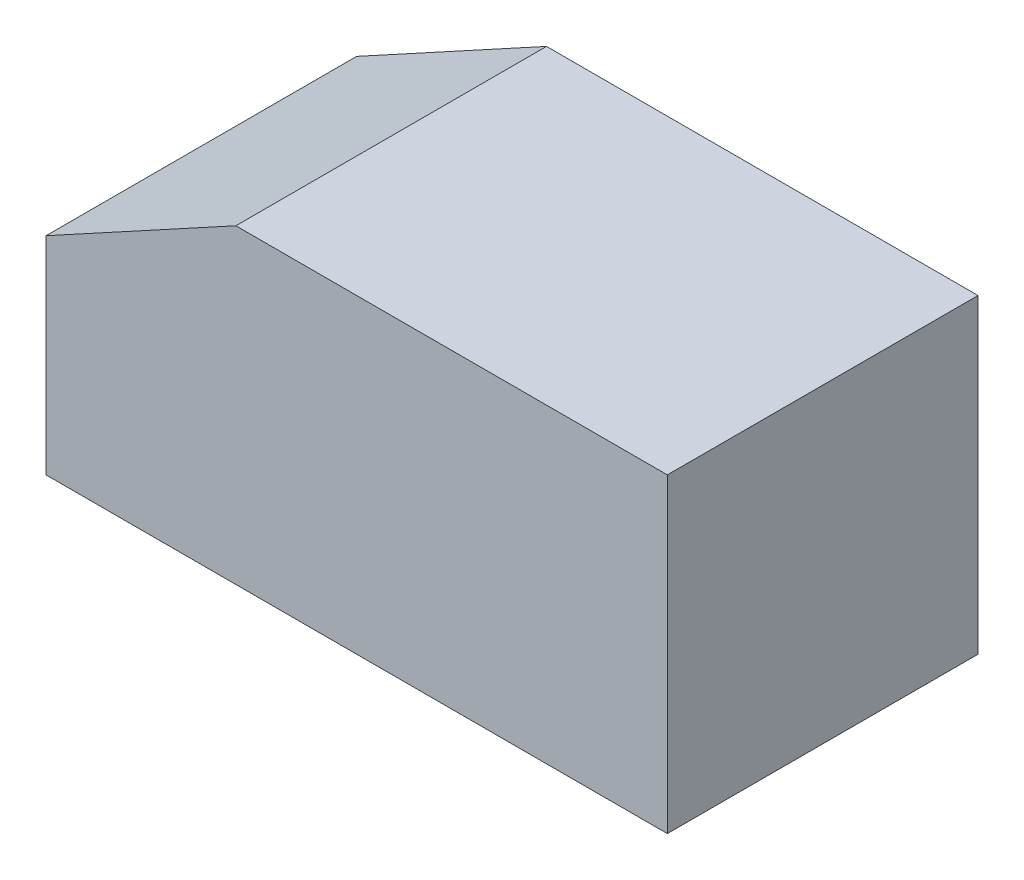
ISO-10303-21;
HEADER;
FILE_DESCRIPTION(('STEP AP214'),'2;1');
FILE_NAME('part.step','',(''),(''),'','','');
FILE_SCHEMA(('AUTOMOTIVE_DESIGN { 1 0 10303 214 1 1 1 1 }'));
ENDSEC;
DATA;
#1=APPLICATION_CONTEXT('core data for automotive mechanical design processes');
#2=APPLICATION_PROTOCOL_DEFINITION('international standard','automotive_design',2000,#1);
#3=PRODUCT_CONTEXT('',#1,'mechanical');
#4=PRODUCT('Part','Part','',(#3));
#5=PRODUCT_RELATED_PRODUCT_CATEGORY('part','',(#4));
#6=PRODUCT_DEFINITION_FORMATION('','',#4);
#7=PRODUCT_DEFINITION_CONTEXT('part definition',#1,'design');
#8=PRODUCT_DEFINITION('design','',#6,#7);
#9=PRODUCT_DEFINITION_SHAPE('','',#8);
#10=(LENGTH_UNIT() NAMED_UNIT(*) SI_UNIT(.MILLI.,.METRE.));
#11=(NAMED_UNIT(*) PLANE_ANGLE_UNIT() SI_UNIT($,.RADIAN.));
#12=(NAMED_UNIT(*) SI_UNIT($,.STERADIAN.) SOLID_ANGLE_UNIT());
#13=UNCERTAINTY_MEASURE_WITH_UNIT(LENGTH_MEASURE(1.E-05),#10,'distance_accuracy_value','');
#14=(GEOMETRIC_REPRESENTATION_CONTEXT(3) GLOBAL_UNCERTAINTY_ASSIGNED_CONTEXT((#13)) GLOBAL_UNIT_ASSIGNED_CONTEXT((#10,
#11,#12)) REPRESENTATION_CONTEXT('',''));
#15=CARTESIAN_POINT('',(0.,0.,0.));
#16=DIRECTION('',(0.,0.,1.));
#17=DIRECTION('',(1.,0.,0.));
#18=AXIS2_PLACEMENT_3D('',#15,#16,#17);
#19=CARTESIAN_POINT('',(-20.5435973455124,9.67298953413507,18.));
#20=DIRECTION('',(0.478852130680573,-0.877895572914384,0.));
#21=DIRECTION('',(0.877895572914384,0.478852130680573,0.));
#22=AXIS2_PLACEMENT_3D('',#19,#20,#21);
#23=PLANE('',#22);
#24=DIRECTION('',(-0.877895572914384,-0.478852130680573,0.));
#25=VECTOR('',#24,1.);
#26=CARTESIAN_POINT('',(-20.5435973455124,9.67298953413507,0.));
#27=LINE('',#26,#25);
#28=CARTESIAN_POINT('',(-20.5435973455124,9.67298953413507,0.));
#29=VERTEX_POINT('',#28);
#30=CARTESIAN_POINT('',(-31.5435973455124,3.67298953413508,0.));
#31=VERTEX_POINT('',#30);
#32=EDGE_CURVE('E108',#29,#31,#27,.T.);
#33=ORIENTED_EDGE('',*,*,#32,.T.);
#34=DIRECTION('',(0.,0.,-1.));
#35=VECTOR('',#34,1.);
#36=CARTESIAN_POINT('',(-31.5435973455124,3.67298953413508,18.));
#37=LINE('',#36,#35);
#38=CARTESIAN_POINT('',(-31.5435973455124,3.67298953413508,18.));
#39=VERTEX_POINT('',#38);
#40=EDGE_CURVE('E11',#39,#31,#37,.T.);
#41=ORIENTED_EDGE('',*,*,#40,.F.);
#42=DIRECTION('',(-0.877895572914384,-0.478852130680573,0.));
#43=VECTOR('',#42,1.);
#44=CARTESIAN_POINT('',(-20.5435973455124,9.67298953413507,18.));
#45=LINE('',#44,#43);
#46=CARTESIAN_POINT('',(-20.5435973455124,9.67298953413507,18.));
#47=VERTEX_POINT('',#46);
#48=EDGE_CURVE('E117',#47,#39,#45,.T.);
#49=ORIENTED_EDGE('',*,*,#48,.F.);
#50=DIRECTION('',(0.,0.,-1.));
#51=VECTOR('',#50,1.);
#52=CARTESIAN_POINT('',(-20.5435973455124,9.67298953413507,18.));
#53=LINE('',#52,#51);
#54=EDGE_CURVE('E104',#47,#29,#53,.T.);
#55=ORIENTED_EDGE('',*,*,#54,.T.);
#56=EDGE_LOOP('',(#33,#41,#49,#55));
#57=FACE_BOUND('',#56,.T.);
#58=ADVANCED_FACE('F35',(#57),#23,.F.);
#59=CARTESIAN_POINT('',(-31.5435973455124,3.67298953413508,18.));
#60=DIRECTION('',(1.,0.,0.));
#61=DIRECTION('',(0.,0.,-1.));
#62=AXIS2_PLACEMENT_3D('',#59,#60,#61);
#63=PLANE('',#62);
#64=DIRECTION('',(0.,-1.,0.));
#65=VECTOR('',#64,1.);
#66=CARTESIAN_POINT('',(-31.5435973455124,3.67298953413508,0.));
#67=LINE('',#66,#65);
#68=CARTESIAN_POINT('',(-31.5435973455124,-8.32701046586492,0.));
#69=VERTEX_POINT('',#68);
#70=EDGE_CURVE('E111',#31,#69,#67,.T.);
#71=ORIENTED_EDGE('',*,*,#70,.T.);
#72=DIRECTION('',(0.,0.,-1.));
#73=VECTOR('',#72,1.);
#74=CARTESIAN_POINT('',(-31.5435973455124,-8.32701046586492,18.));
#75=LINE('',#74,#73);
#76=CARTESIAN_POINT('',(-31.5435973455124,-8.32701046586492,18.));
#77=VERTEX_POINT('',#76);
#78=EDGE_CURVE('E43',#77,#69,#75,.T.);
#79=ORIENTED_EDGE('',*,*,#78,.F.);
#80=DIRECTION('',(0.,-1.,0.));
#81=VECTOR('',#80,1.);
#82=CARTESIAN_POINT('',(-31.5435973455124,3.67298953413508,18.));
#83=LINE('',#82,#81);
#84=EDGE_CURVE('E85',#39,#77,#83,.T.);
#85=ORIENTED_EDGE('',*,*,#84,.F.);
#86=ORIENTED_EDGE('',*,*,#40,.T.);
#87=EDGE_LOOP('',(#71,#79,#85,#86));
#88=FACE_BOUND('',#87,.T.);
#89=ADVANCED_FACE('F119',(#88),#63,.F.);
#90=CARTESIAN_POINT('',(-1.54359734551241,-8.32701046586492,18.));
#91=DIRECTION('',(0.,1.,0.));
#92=DIRECTION('',(0.,0.,1.));
#93=AXIS2_PLACEMENT_3D('',#90,#91,#92);
#94=PLANE('',#93);
#95=DIRECTION('',(1.,0.,0.));
#96=VECTOR('',#95,1.);
#97=CARTESIAN_POINT('',(-1.54359734551241,-8.32701046586492,0.));
#98=LINE('',#97,#96);
#99=CARTESIAN_POINT('',(4.45640265448759,-8.32701046586492,0.));
#100=VERTEX_POINT('',#99);
#101=EDGE_CURVE('E99',#69,#100,#98,.T.);
#102=ORIENTED_EDGE('',*,*,#101,.T.);
#103=DIRECTION('',(0.,0.,-1.));
#104=VECTOR('',#103,1.);
#105=CARTESIAN_POINT('',(4.45640265448759,-8.32701046586492,18.));
#106=LINE('',#105,#104);
#107=CARTESIAN_POINT('',(4.45640265448759,-8.32701046586492,18.));
#108=VERTEX_POINT('',#107);
#109=EDGE_CURVE('E97',#108,#100,#106,.T.);
#110=ORIENTED_EDGE('',*,*,#109,.F.);
#111=DIRECTION('',(1.,0.,0.));
#112=VECTOR('',#111,1.);
#113=CARTESIAN_POINT('',(-31.5435973455124,-8.32701046586492,18.));
#114=LINE('',#113,#112);
#115=EDGE_CURVE('E89',#77,#108,#114,.T.);
#116=ORIENTED_EDGE('',*,*,#115,.F.);
#117=ORIENTED_EDGE('',*,*,#78,.T.);
#118=EDGE_LOOP('',(#102,#110,#116,#117));
#119=FACE_BOUND('',#118,.T.);
#120=ADVANCED_FACE('F98',(#119),#94,.F.);
#121=CARTESIAN_POINT('',(4.45640265448759,-8.32701046586492,18.));
#122=DIRECTION('',(-1.,0.,0.));
#123=DIRECTION('',(0.,0.,1.));
#124=AXIS2_PLACEMENT_3D('',#121,#122,#123);
#125=PLANE('',#124);
#126=DIRECTION('',(0.,1.,0.));
#127=VECTOR('',#126,1.);
#128=CARTESIAN_POINT('',(4.45640265448759,-8.32701046586492,0.));
#129=LINE('',#128,#127);
#130=CARTESIAN_POINT('',(4.45640265448759,9.67298953413508,0.));
#131=VERTEX_POINT('',#130);
#132=EDGE_CURVE('E71',#100,#131,#129,.T.);
#133=ORIENTED_EDGE('',*,*,#132,.T.);
#134=DIRECTION('',(0.,0.,-1.));
#135=VECTOR('',#134,1.);
#136=CARTESIAN_POINT('',(4.45640265448759,9.67298953413508,18.));
#137=LINE('',#136,#135);
#138=CARTESIAN_POINT('',(4.45640265448759,9.67298953413508,18.));
#139=VERTEX_POINT('',#138);
#140=EDGE_CURVE('E100',#139,#131,#137,.T.);
#141=ORIENTED_EDGE('',*,*,#140,.F.);
#142=DIRECTION('',(0.,1.,0.));
#143=VECTOR('',#142,1.);
#144=CARTESIAN_POINT('',(4.45640265448759,-8.32701046586492,18.));
#145=LINE('',#144,#143);
#146=EDGE_CURVE('E93',#108,#139,#145,.T.);
#147=ORIENTED_EDGE('',*,*,#146,.F.);
#148=ORIENTED_EDGE('',*,*,#109,.T.);
#149=EDGE_LOOP('',(#133,#141,#147,#148));
#150=FACE_BOUND('',#149,.T.);
#151=ADVANCED_FACE('F102',(#150),#125,.F.);
#152=CARTESIAN_POINT('',(4.45640265448759,9.67298953413508,18.));
#153=DIRECTION('',(0.,-1.,0.));
#154=DIRECTION('',(1.,0.,0.));
#155=AXIS2_PLACEMENT_3D('',#152,#153,#154);
#156=PLANE('',#155);
#157=DIRECTION('',(-1.,0.,0.));
#158=VECTOR('',#157,1.);
#159=CARTESIAN_POINT('',(4.45640265448759,9.67298953413508,0.));
#160=LINE('',#159,#158);
#161=EDGE_CURVE('E77',#131,#29,#160,.T.);
#162=ORIENTED_EDGE('',*,*,#161,.T.);
#163=ORIENTED_EDGE('',*,*,#54,.F.);
#164=DIRECTION('',(-1.,0.,0.));
#165=VECTOR('',#164,1.);
#166=CARTESIAN_POINT('',(4.45640265448759,9.67298953413508,18.));
#167=LINE('',#166,#165);
#168=EDGE_CURVE('E51',#139,#47,#167,.T.);
#169=ORIENTED_EDGE('',*,*,#168,.F.);
#170=ORIENTED_EDGE('',*,*,#140,.T.);
#171=EDGE_LOOP('',(#162,#163,#169,#170));
#172=FACE_BOUND('',#171,.T.);
#173=ADVANCED_FACE('F126',(#172),#156,.F.);
#174=CARTESIAN_POINT('',(0.,0.,18.));
#175=DIRECTION('',(0.,0.,1.));
#176=DIRECTION('',(1.,0.,0.));
#177=AXIS2_PLACEMENT_3D('',#174,#175,#176);
#178=PLANE('',#177);
#179=ORIENTED_EDGE('',*,*,#48,.T.);
#180=ORIENTED_EDGE('',*,*,#84,.T.);
#181=ORIENTED_EDGE('',*,*,#115,.T.);
#182=ORIENTED_EDGE('',*,*,#146,.T.);
#183=ORIENTED_EDGE('',*,*,#168,.T.);
#184=EDGE_LOOP('',(#179,#180,#181,#182,#183));
#185=FACE_BOUND('',#184,.T.);
#186=ADVANCED_FACE('F91',(#185),#178,.T.);
#187=CARTESIAN_POINT('',(0.,0.,0.));
#188=DIRECTION('',(0.,0.,1.));
#189=DIRECTION('',(1.,0.,0.));
#190=AXIS2_PLACEMENT_3D('',#187,#188,#189);
#191=PLANE('',#190);
#192=ORIENTED_EDGE('',*,*,#32,.F.);
#193=ORIENTED_EDGE('',*,*,#161,.F.);
#194=ORIENTED_EDGE('',*,*,#132,.F.);
#195=ORIENTED_EDGE('',*,*,#101,.F.);
#196=ORIENTED_EDGE('',*,*,#70,.F.);
#197=EDGE_LOOP('',(#192,#193,#194,#195,#196));
#198=FACE_BOUND('',#197,.T.);
#199=ADVANCED_FACE('F123',(#198),#191,.F.);
#200=CLOSED_SHELL('',(#58,#89,#120,#151,#173,#186,#199));
#201=MANIFOLD_SOLID_BREP('B2',#200);
#202=ADVANCED_BREP_SHAPE_REPRESENTATION('',(#18,#201),#14);
#203=SHAPE_DEFINITION_REPRESENTATION(#9,#202);
ENDSEC;
END-ISO-10303-21;
